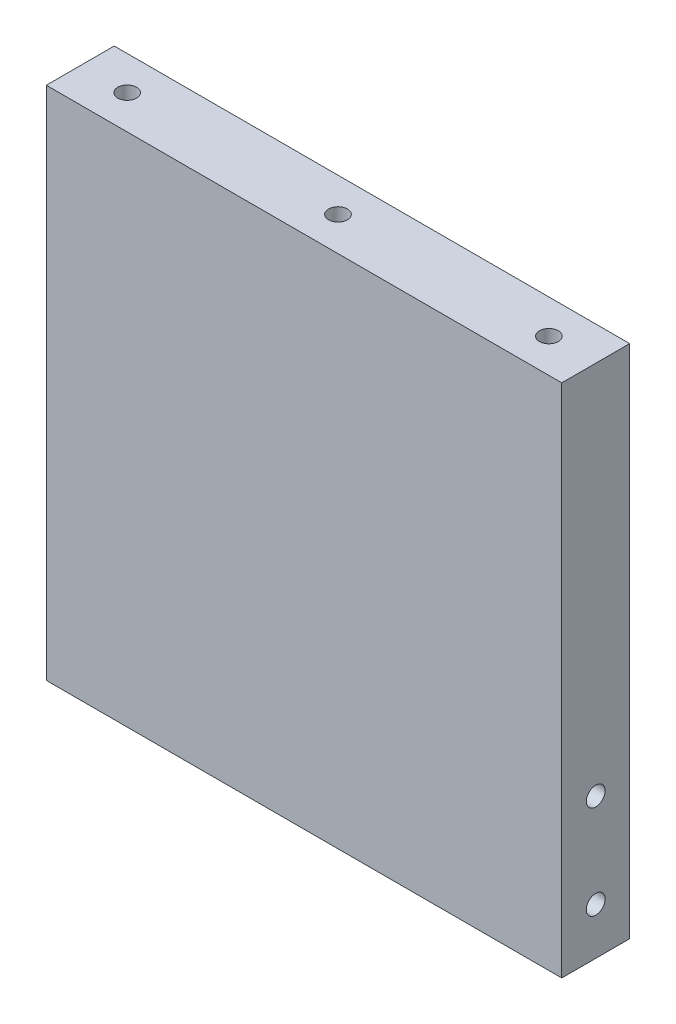
ISO-10303-21;
HEADER;
FILE_DESCRIPTION(('STEP AP214'),'2;1');
FILE_NAME('part.step','',(''),(''),'','','');
FILE_SCHEMA(('AUTOMOTIVE_DESIGN { 1 0 10303 214 1 1 1 1 }'));
ENDSEC;
DATA;
#1=APPLICATION_CONTEXT('core data for automotive mechanical design processes');
#2=APPLICATION_PROTOCOL_DEFINITION('international standard','automotive_design',2000,#1);
#3=PRODUCT_CONTEXT('',#1,'mechanical');
#4=PRODUCT('Part','Part','',(#3));
#5=PRODUCT_RELATED_PRODUCT_CATEGORY('part','',(#4));
#6=PRODUCT_DEFINITION_FORMATION('','',#4);
#7=PRODUCT_DEFINITION_CONTEXT('part definition',#1,'design');
#8=PRODUCT_DEFINITION('design','',#6,#7);
#9=PRODUCT_DEFINITION_SHAPE('','',#8);
#10=(LENGTH_UNIT() NAMED_UNIT(*) SI_UNIT(.MILLI.,.METRE.));
#11=(NAMED_UNIT(*) PLANE_ANGLE_UNIT() SI_UNIT($,.RADIAN.));
#12=(NAMED_UNIT(*) SI_UNIT($,.STERADIAN.) SOLID_ANGLE_UNIT());
#13=UNCERTAINTY_MEASURE_WITH_UNIT(LENGTH_MEASURE(1.E-05),#10,'distance_accuracy_value','');
#14=(GEOMETRIC_REPRESENTATION_CONTEXT(3) GLOBAL_UNCERTAINTY_ASSIGNED_CONTEXT((#13)) GLOBAL_UNIT_ASSIGNED_CONTEXT((#10,
#11,#12)) REPRESENTATION_CONTEXT('',''));
#15=CARTESIAN_POINT('',(0.,0.,0.));
#16=DIRECTION('',(0.,0.,1.));
#17=DIRECTION('',(1.,0.,0.));
#18=AXIS2_PLACEMENT_3D('',#15,#16,#17);
#19=CARTESIAN_POINT('',(0.,139.7,0.));
#20=DIRECTION('',(1.,0.,0.));
#21=DIRECTION('',(0.,0.,-1.));
#22=AXIS2_PLACEMENT_3D('',#19,#20,#21);
#23=PLANE('',#22);
#24=CARTESIAN_POINT('',(0.,38.1,-9.2075));
#25=DIRECTION('',(-1.,0.,0.));
#26=DIRECTION('',(0.,0.,1.));
#27=AXIS2_PLACEMENT_3D('',#24,#25,#26);
#28=CIRCLE('',#27,2.5527);
#29=CARTESIAN_POINT('',(0.,38.1,-6.6548));
#30=VERTEX_POINT('',#29);
#31=EDGE_CURVE('E144',#30,#30,#28,.T.);
#32=ORIENTED_EDGE('',*,*,#31,.F.);
#33=EDGE_LOOP('',(#32));
#34=FACE_BOUND('',#33,.T.);
#35=CARTESIAN_POINT('',(0.,12.7,-9.2075));
#36=DIRECTION('',(-1.,0.,0.));
#37=DIRECTION('',(0.,0.,1.));
#38=AXIS2_PLACEMENT_3D('',#35,#36,#37);
#39=CIRCLE('',#38,2.5527);
#40=CARTESIAN_POINT('',(0.,12.7,-6.6548));
#41=VERTEX_POINT('',#40);
#42=EDGE_CURVE('E143',#41,#41,#39,.T.);
#43=ORIENTED_EDGE('',*,*,#42,.F.);
#44=EDGE_LOOP('',(#43));
#45=FACE_BOUND('',#44,.T.);
#46=DIRECTION('',(0.,0.,1.));
#47=VECTOR('',#46,1.);
#48=CARTESIAN_POINT('',(0.,0.,0.));
#49=LINE('',#48,#47);
#50=CARTESIAN_POINT('',(0.,0.,-18.415));
#51=VERTEX_POINT('',#50);
#52=CARTESIAN_POINT('',(0.,0.,0.));
#53=VERTEX_POINT('',#52);
#54=EDGE_CURVE('E199',#51,#53,#49,.T.);
#55=ORIENTED_EDGE('',*,*,#54,.T.);
#56=DIRECTION('',(0.,-1.,0.));
#57=VECTOR('',#56,1.);
#58=CARTESIAN_POINT('',(0.,139.7,0.));
#59=LINE('',#58,#57);
#60=CARTESIAN_POINT('',(0.,139.7,0.));
#61=VERTEX_POINT('',#60);
#62=EDGE_CURVE('E13',#61,#53,#59,.T.);
#63=ORIENTED_EDGE('',*,*,#62,.F.);
#64=DIRECTION('',(0.,0.,1.));
#65=VECTOR('',#64,1.);
#66=CARTESIAN_POINT('',(0.,139.7,0.));
#67=LINE('',#66,#65);
#68=CARTESIAN_POINT('',(0.,139.7,-18.415));
#69=VERTEX_POINT('',#68);
#70=EDGE_CURVE('E200',#69,#61,#67,.T.);
#71=ORIENTED_EDGE('',*,*,#70,.F.);
#72=DIRECTION('',(0.,-1.,0.));
#73=VECTOR('',#72,1.);
#74=CARTESIAN_POINT('',(0.,139.7,-18.415));
#75=LINE('',#74,#73);
#76=EDGE_CURVE('E210',#69,#51,#75,.T.);
#77=ORIENTED_EDGE('',*,*,#76,.T.);
#78=EDGE_LOOP('',(#55,#63,#71,#77));
#79=FACE_BOUND('',#78,.T.);
#80=ADVANCED_FACE('F62',(#34,#45,#79),#23,.F.);
#81=CARTESIAN_POINT('',(0.,139.7,0.));
#82=DIRECTION('',(0.,0.,-1.));
#83=DIRECTION('',(-1.,0.,0.));
#84=AXIS2_PLACEMENT_3D('',#81,#82,#83);
#85=PLANE('',#84);
#86=DIRECTION('',(1.,0.,0.));
#87=VECTOR('',#86,1.);
#88=CARTESIAN_POINT('',(0.,0.,0.));
#89=LINE('',#88,#87);
#90=CARTESIAN_POINT('',(139.7,0.,0.));
#91=VERTEX_POINT('',#90);
#92=EDGE_CURVE('E214',#53,#91,#89,.T.);
#93=ORIENTED_EDGE('',*,*,#92,.T.);
#94=DIRECTION('',(0.,-1.,0.));
#95=VECTOR('',#94,1.);
#96=CARTESIAN_POINT('',(139.7,139.7,0.));
#97=LINE('',#96,#95);
#98=CARTESIAN_POINT('',(139.7,139.7,0.));
#99=VERTEX_POINT('',#98);
#100=EDGE_CURVE('E71',#99,#91,#97,.T.);
#101=ORIENTED_EDGE('',*,*,#100,.F.);
#102=DIRECTION('',(1.,0.,0.));
#103=VECTOR('',#102,1.);
#104=CARTESIAN_POINT('',(0.,139.7,0.));
#105=LINE('',#104,#103);
#106=EDGE_CURVE('E110',#61,#99,#105,.T.);
#107=ORIENTED_EDGE('',*,*,#106,.F.);
#108=ORIENTED_EDGE('',*,*,#62,.T.);
#109=EDGE_LOOP('',(#93,#101,#107,#108));
#110=FACE_BOUND('',#109,.T.);
#111=ADVANCED_FACE('F246',(#110),#85,.F.);
#112=CARTESIAN_POINT('',(139.7,139.7,0.));
#113=DIRECTION('',(-1.,0.,0.));
#114=DIRECTION('',(0.,0.,1.));
#115=AXIS2_PLACEMENT_3D('',#112,#113,#114);
#116=PLANE('',#115);
#117=CARTESIAN_POINT('',(139.7,38.1,-9.2075));
#118=DIRECTION('',(1.,0.,0.));
#119=DIRECTION('',(0.,0.,-1.));
#120=AXIS2_PLACEMENT_3D('',#117,#118,#119);
#121=CIRCLE('',#120,2.5527);
#122=CARTESIAN_POINT('',(139.7,38.1,-11.7602));
#123=VERTEX_POINT('',#122);
#124=EDGE_CURVE('E167',#123,#123,#121,.T.);
#125=ORIENTED_EDGE('',*,*,#124,.F.);
#126=EDGE_LOOP('',(#125));
#127=FACE_BOUND('',#126,.T.);
#128=CARTESIAN_POINT('',(139.7,12.7,-9.2075));
#129=DIRECTION('',(1.,0.,0.));
#130=DIRECTION('',(0.,0.,-1.));
#131=AXIS2_PLACEMENT_3D('',#128,#129,#130);
#132=CIRCLE('',#131,2.5527);
#133=CARTESIAN_POINT('',(139.7,12.7,-11.7602));
#134=VERTEX_POINT('',#133);
#135=EDGE_CURVE('E175',#134,#134,#132,.T.);
#136=ORIENTED_EDGE('',*,*,#135,.F.);
#137=EDGE_LOOP('',(#136));
#138=FACE_BOUND('',#137,.T.);
#139=DIRECTION('',(0.,0.,-1.));
#140=VECTOR('',#139,1.);
#141=CARTESIAN_POINT('',(139.7,0.,0.));
#142=LINE('',#141,#140);
#143=CARTESIAN_POINT('',(139.7,0.,-18.415));
#144=VERTEX_POINT('',#143);
#145=EDGE_CURVE('E97',#91,#144,#142,.T.);
#146=ORIENTED_EDGE('',*,*,#145,.T.);
#147=DIRECTION('',(0.,-1.,0.));
#148=VECTOR('',#147,1.);
#149=CARTESIAN_POINT('',(139.7,139.7,-18.415));
#150=LINE('',#149,#148);
#151=CARTESIAN_POINT('',(139.7,139.7,-18.415));
#152=VERTEX_POINT('',#151);
#153=EDGE_CURVE('E223',#152,#144,#150,.T.);
#154=ORIENTED_EDGE('',*,*,#153,.F.);
#155=DIRECTION('',(0.,0.,-1.));
#156=VECTOR('',#155,1.);
#157=CARTESIAN_POINT('',(139.7,139.7,0.));
#158=LINE('',#157,#156);
#159=EDGE_CURVE('E205',#99,#152,#158,.T.);
#160=ORIENTED_EDGE('',*,*,#159,.F.);
#161=ORIENTED_EDGE('',*,*,#100,.T.);
#162=EDGE_LOOP('',(#146,#154,#160,#161));
#163=FACE_BOUND('',#162,.T.);
#164=ADVANCED_FACE('F229',(#127,#138,#163),#116,.F.);
#165=CARTESIAN_POINT('',(0.,139.7,-18.415));
#166=DIRECTION('',(0.,0.,1.));
#167=DIRECTION('',(1.,0.,0.));
#168=AXIS2_PLACEMENT_3D('',#165,#166,#167);
#169=PLANE('',#168);
#170=DIRECTION('',(-1.,0.,0.));
#171=VECTOR('',#170,1.);
#172=CARTESIAN_POINT('',(0.,0.,-18.415));
#173=LINE('',#172,#171);
#174=EDGE_CURVE('E103',#144,#51,#173,.T.);
#175=ORIENTED_EDGE('',*,*,#174,.T.);
#176=ORIENTED_EDGE('',*,*,#76,.F.);
#177=DIRECTION('',(-1.,0.,0.));
#178=VECTOR('',#177,1.);
#179=CARTESIAN_POINT('',(0.,139.7,-18.415));
#180=LINE('',#179,#178);
#181=EDGE_CURVE('E79',#152,#69,#180,.T.);
#182=ORIENTED_EDGE('',*,*,#181,.F.);
#183=ORIENTED_EDGE('',*,*,#153,.T.);
#184=EDGE_LOOP('',(#175,#176,#182,#183));
#185=FACE_BOUND('',#184,.T.);
#186=ADVANCED_FACE('F236',(#185),#169,.F.);
#187=CARTESIAN_POINT('',(0.,139.7,0.));
#188=DIRECTION('',(0.,-1.,0.));
#189=DIRECTION('',(0.,0.,-1.));
#190=AXIS2_PLACEMENT_3D('',#187,#188,#189);
#191=PLANE('',#190);
#192=CARTESIAN_POINT('',(127.,139.7,-9.2075));
#193=DIRECTION('',(0.,1.,0.));
#194=DIRECTION('',(0.,0.,1.));
#195=AXIS2_PLACEMENT_3D('',#192,#193,#194);
#196=CIRCLE('',#195,2.55269999999999);
#197=CARTESIAN_POINT('',(127.,139.7,-6.65480000000001));
#198=VERTEX_POINT('',#197);
#199=EDGE_CURVE('E159',#198,#198,#196,.T.);
#200=ORIENTED_EDGE('',*,*,#199,.F.);
#201=EDGE_LOOP('',(#200));
#202=FACE_BOUND('',#201,.T.);
#203=CARTESIAN_POINT('',(69.85,139.7,-9.2075));
#204=DIRECTION('',(0.,1.,0.));
#205=DIRECTION('',(0.,0.,1.));
#206=AXIS2_PLACEMENT_3D('',#203,#204,#205);
#207=CIRCLE('',#206,2.55269999999999);
#208=CARTESIAN_POINT('',(69.85,139.7,-6.65480000000001));
#209=VERTEX_POINT('',#208);
#210=EDGE_CURVE('E183',#209,#209,#207,.T.);
#211=ORIENTED_EDGE('',*,*,#210,.F.);
#212=EDGE_LOOP('',(#211));
#213=FACE_BOUND('',#212,.T.);
#214=CARTESIAN_POINT('',(12.7,139.7,-9.2075));
#215=DIRECTION('',(0.,1.,0.));
#216=DIRECTION('',(0.,0.,1.));
#217=AXIS2_PLACEMENT_3D('',#214,#215,#216);
#218=CIRCLE('',#217,2.5527);
#219=CARTESIAN_POINT('',(12.7,139.7,-6.6548));
#220=VERTEX_POINT('',#219);
#221=EDGE_CURVE('E191',#220,#220,#218,.T.);
#222=ORIENTED_EDGE('',*,*,#221,.F.);
#223=EDGE_LOOP('',(#222));
#224=FACE_BOUND('',#223,.T.);
#225=ORIENTED_EDGE('',*,*,#70,.T.);
#226=ORIENTED_EDGE('',*,*,#106,.T.);
#227=ORIENTED_EDGE('',*,*,#159,.T.);
#228=ORIENTED_EDGE('',*,*,#181,.T.);
#229=EDGE_LOOP('',(#225,#226,#227,#228));
#230=FACE_BOUND('',#229,.T.);
#231=ADVANCED_FACE('F238',(#202,#213,#224,#230),#191,.F.);
#232=CARTESIAN_POINT('',(0.,0.,0.));
#233=DIRECTION('',(0.,-1.,0.));
#234=DIRECTION('',(0.,0.,-1.));
#235=AXIS2_PLACEMENT_3D('',#232,#233,#234);
#236=PLANE('',#235);
#237=ORIENTED_EDGE('',*,*,#54,.F.);
#238=ORIENTED_EDGE('',*,*,#174,.F.);
#239=ORIENTED_EDGE('',*,*,#145,.F.);
#240=ORIENTED_EDGE('',*,*,#92,.F.);
#241=EDGE_LOOP('',(#237,#238,#239,#240));
#242=FACE_BOUND('',#241,.T.);
#243=ADVANCED_FACE('F232',(#242),#236,.T.);
#244=CARTESIAN_POINT('',(12.7,120.65,-9.2075));
#245=DIRECTION('',(0.,1.,0.));
#246=DIRECTION('',(0.,0.,1.));
#247=AXIS2_PLACEMENT_3D('',#244,#245,#246);
#248=CONICAL_SURFACE('',#247,2.5527,1.02974425867665);
#249=CARTESIAN_POINT('',(12.7,119.116183097808,-9.2075));
#250=VERTEX_POINT('',#249);
#251=VERTEX_LOOP('',#250);
#252=FACE_BOUND('',#251,.T.);
#253=CARTESIAN_POINT('',(12.7,120.65,-9.2075));
#254=DIRECTION('',(0.,1.,0.));
#255=DIRECTION('',(0.,0.,1.));
#256=AXIS2_PLACEMENT_3D('',#253,#254,#255);
#257=CIRCLE('',#256,2.5527);
#258=CARTESIAN_POINT('',(12.7,120.65,-6.6548));
#259=VERTEX_POINT('',#258);
#260=EDGE_CURVE('E195',#259,#259,#257,.T.);
#261=ORIENTED_EDGE('',*,*,#260,.T.);
#262=EDGE_LOOP('',(#261));
#263=FACE_BOUND('',#262,.T.);
#264=ADVANCED_FACE('F306',(#252,#263),#248,.F.);
#265=CARTESIAN_POINT('',(12.7,139.7,-9.2075));
#266=DIRECTION('',(0.,1.,0.));
#267=DIRECTION('',(0.,0.,1.));
#268=AXIS2_PLACEMENT_3D('',#265,#266,#267);
#269=CYLINDRICAL_SURFACE('',#268,2.5527);
#270=ORIENTED_EDGE('',*,*,#260,.F.);
#271=EDGE_LOOP('',(#270));
#272=FACE_BOUND('',#271,.T.);
#273=ORIENTED_EDGE('',*,*,#221,.T.);
#274=EDGE_LOOP('',(#273));
#275=FACE_BOUND('',#274,.T.);
#276=ADVANCED_FACE('F302',(#272,#275),#269,.F.);
#277=CARTESIAN_POINT('',(69.85,120.65,-9.2075));
#278=DIRECTION('',(0.,1.,0.));
#279=DIRECTION('',(0.,0.,1.));
#280=AXIS2_PLACEMENT_3D('',#277,#278,#279);
#281=CONICAL_SURFACE('',#280,2.55269999999999,1.02974425867665);
#282=CARTESIAN_POINT('',(69.85,119.116183097808,-9.2075));
#283=VERTEX_POINT('',#282);
#284=VERTEX_LOOP('',#283);
#285=FACE_BOUND('',#284,.T.);
#286=CARTESIAN_POINT('',(69.85,120.65,-9.2075));
#287=DIRECTION('',(0.,1.,0.));
#288=DIRECTION('',(0.,0.,1.));
#289=AXIS2_PLACEMENT_3D('',#286,#287,#288);
#290=CIRCLE('',#289,2.55269999999999);
#291=CARTESIAN_POINT('',(69.85,120.65,-6.65480000000001));
#292=VERTEX_POINT('',#291);
#293=EDGE_CURVE('E187',#292,#292,#290,.T.);
#294=ORIENTED_EDGE('',*,*,#293,.T.);
#295=EDGE_LOOP('',(#294));
#296=FACE_BOUND('',#295,.T.);
#297=ADVANCED_FACE('F298',(#285,#296),#281,.F.);
#298=CARTESIAN_POINT('',(69.85,139.7,-9.2075));
#299=DIRECTION('',(0.,1.,0.));
#300=DIRECTION('',(0.,0.,1.));
#301=AXIS2_PLACEMENT_3D('',#298,#299,#300);
#302=CYLINDRICAL_SURFACE('',#301,2.55269999999999);
#303=ORIENTED_EDGE('',*,*,#293,.F.);
#304=EDGE_LOOP('',(#303));
#305=FACE_BOUND('',#304,.T.);
#306=ORIENTED_EDGE('',*,*,#210,.T.);
#307=EDGE_LOOP('',(#306));
#308=FACE_BOUND('',#307,.T.);
#309=ADVANCED_FACE('F294',(#305,#308),#302,.F.);
#310=CARTESIAN_POINT('',(120.65,12.7,-9.2075));
#311=DIRECTION('',(1.,0.,0.));
#312=DIRECTION('',(0.,0.,-1.));
#313=AXIS2_PLACEMENT_3D('',#310,#311,#312);
#314=CONICAL_SURFACE('',#313,2.5527,1.02974425867665);
#315=CARTESIAN_POINT('',(119.116183097808,12.7,-9.2075));
#316=VERTEX_POINT('',#315);
#317=VERTEX_LOOP('',#316);
#318=FACE_BOUND('',#317,.T.);
#319=CARTESIAN_POINT('',(120.65,12.7,-9.2075));
#320=DIRECTION('',(1.,0.,0.));
#321=DIRECTION('',(0.,0.,-1.));
#322=AXIS2_PLACEMENT_3D('',#319,#320,#321);
#323=CIRCLE('',#322,2.5527);
#324=CARTESIAN_POINT('',(120.65,12.7,-11.7602));
#325=VERTEX_POINT('',#324);
#326=EDGE_CURVE('E179',#325,#325,#323,.T.);
#327=ORIENTED_EDGE('',*,*,#326,.T.);
#328=EDGE_LOOP('',(#327));
#329=FACE_BOUND('',#328,.T.);
#330=ADVANCED_FACE('F290',(#318,#329),#314,.F.);
#331=CARTESIAN_POINT('',(139.7,12.7,-9.2075));
#332=DIRECTION('',(1.,0.,0.));
#333=DIRECTION('',(0.,0.,-1.));
#334=AXIS2_PLACEMENT_3D('',#331,#332,#333);
#335=CYLINDRICAL_SURFACE('',#334,2.5527);
#336=ORIENTED_EDGE('',*,*,#326,.F.);
#337=EDGE_LOOP('',(#336));
#338=FACE_BOUND('',#337,.T.);
#339=ORIENTED_EDGE('',*,*,#135,.T.);
#340=EDGE_LOOP('',(#339));
#341=FACE_BOUND('',#340,.T.);
#342=ADVANCED_FACE('F286',(#338,#341),#335,.F.);
#343=CARTESIAN_POINT('',(120.65,38.1,-9.2075));
#344=DIRECTION('',(1.,0.,0.));
#345=DIRECTION('',(0.,0.,-1.));
#346=AXIS2_PLACEMENT_3D('',#343,#344,#345);
#347=CONICAL_SURFACE('',#346,2.5527,1.02974425867665);
#348=CARTESIAN_POINT('',(119.116183097808,38.1,-9.2075));
#349=VERTEX_POINT('',#348);
#350=VERTEX_LOOP('',#349);
#351=FACE_BOUND('',#350,.T.);
#352=CARTESIAN_POINT('',(120.65,38.1,-9.2075));
#353=DIRECTION('',(1.,0.,0.));
#354=DIRECTION('',(0.,0.,-1.));
#355=AXIS2_PLACEMENT_3D('',#352,#353,#354);
#356=CIRCLE('',#355,2.5527);
#357=CARTESIAN_POINT('',(120.65,38.1,-11.7602));
#358=VERTEX_POINT('',#357);
#359=EDGE_CURVE('E171',#358,#358,#356,.T.);
#360=ORIENTED_EDGE('',*,*,#359,.T.);
#361=EDGE_LOOP('',(#360));
#362=FACE_BOUND('',#361,.T.);
#363=ADVANCED_FACE('F282',(#351,#362),#347,.F.);
#364=CARTESIAN_POINT('',(139.7,38.1,-9.2075));
#365=DIRECTION('',(1.,0.,0.));
#366=DIRECTION('',(0.,0.,-1.));
#367=AXIS2_PLACEMENT_3D('',#364,#365,#366);
#368=CYLINDRICAL_SURFACE('',#367,2.5527);
#369=ORIENTED_EDGE('',*,*,#359,.F.);
#370=EDGE_LOOP('',(#369));
#371=FACE_BOUND('',#370,.T.);
#372=ORIENTED_EDGE('',*,*,#124,.T.);
#373=EDGE_LOOP('',(#372));
#374=FACE_BOUND('',#373,.T.);
#375=ADVANCED_FACE('F278',(#371,#374),#368,.F.);
#376=CARTESIAN_POINT('',(127.,120.65,-9.2075));
#377=DIRECTION('',(0.,1.,0.));
#378=DIRECTION('',(0.,0.,1.));
#379=AXIS2_PLACEMENT_3D('',#376,#377,#378);
#380=CONICAL_SURFACE('',#379,2.55269999999999,1.02974425867665);
#381=CARTESIAN_POINT('',(127.,119.116183097808,-9.2075));
#382=VERTEX_POINT('',#381);
#383=VERTEX_LOOP('',#382);
#384=FACE_BOUND('',#383,.T.);
#385=CARTESIAN_POINT('',(127.,120.65,-9.2075));
#386=DIRECTION('',(0.,1.,0.));
#387=DIRECTION('',(0.,0.,1.));
#388=AXIS2_PLACEMENT_3D('',#385,#386,#387);
#389=CIRCLE('',#388,2.55269999999999);
#390=CARTESIAN_POINT('',(127.,120.65,-6.65480000000001));
#391=VERTEX_POINT('',#390);
#392=EDGE_CURVE('E163',#391,#391,#389,.T.);
#393=ORIENTED_EDGE('',*,*,#392,.T.);
#394=EDGE_LOOP('',(#393));
#395=FACE_BOUND('',#394,.T.);
#396=ADVANCED_FACE('F274',(#384,#395),#380,.F.);
#397=CARTESIAN_POINT('',(127.,139.7,-9.2075));
#398=DIRECTION('',(0.,1.,0.));
#399=DIRECTION('',(0.,0.,1.));
#400=AXIS2_PLACEMENT_3D('',#397,#398,#399);
#401=CYLINDRICAL_SURFACE('',#400,2.55269999999999);
#402=ORIENTED_EDGE('',*,*,#392,.F.);
#403=EDGE_LOOP('',(#402));
#404=FACE_BOUND('',#403,.T.);
#405=ORIENTED_EDGE('',*,*,#199,.T.);
#406=EDGE_LOOP('',(#405));
#407=FACE_BOUND('',#406,.T.);
#408=ADVANCED_FACE('F266',(#404,#407),#401,.F.);
#409=CARTESIAN_POINT('',(19.05,12.7,-9.2075));
#410=DIRECTION('',(-1.,0.,0.));
#411=DIRECTION('',(0.,0.,1.));
#412=AXIS2_PLACEMENT_3D('',#409,#410,#411);
#413=CONICAL_SURFACE('',#412,2.5527,1.02974425867665);
#414=CARTESIAN_POINT('',(20.5838169021917,12.7,-9.2075));
#415=VERTEX_POINT('',#414);
#416=VERTEX_LOOP('',#415);
#417=FACE_BOUND('',#416,.T.);
#418=CARTESIAN_POINT('',(19.05,12.7,-9.2075));
#419=DIRECTION('',(-1.,0.,0.));
#420=DIRECTION('',(0.,0.,1.));
#421=AXIS2_PLACEMENT_3D('',#418,#419,#420);
#422=CIRCLE('',#421,2.5527);
#423=CARTESIAN_POINT('',(19.05,12.7,-6.6548));
#424=VERTEX_POINT('',#423);
#425=EDGE_CURVE('E151',#424,#424,#422,.T.);
#426=ORIENTED_EDGE('',*,*,#425,.T.);
#427=EDGE_LOOP('',(#426));
#428=FACE_BOUND('',#427,.T.);
#429=ADVANCED_FACE('F260',(#417,#428),#413,.F.);
#430=CARTESIAN_POINT('',(0.,12.7,-9.2075));
#431=DIRECTION('',(-1.,0.,0.));
#432=DIRECTION('',(0.,0.,1.));
#433=AXIS2_PLACEMENT_3D('',#430,#431,#432);
#434=CYLINDRICAL_SURFACE('',#433,2.5527);
#435=ORIENTED_EDGE('',*,*,#425,.F.);
#436=EDGE_LOOP('',(#435));
#437=FACE_BOUND('',#436,.T.);
#438=ORIENTED_EDGE('',*,*,#42,.T.);
#439=EDGE_LOOP('',(#438));
#440=FACE_BOUND('',#439,.T.);
#441=ADVANCED_FACE('F136',(#437,#440),#434,.F.);
#442=CARTESIAN_POINT('',(19.05,38.1,-9.2075));
#443=DIRECTION('',(-1.,0.,0.));
#444=DIRECTION('',(0.,0.,1.));
#445=AXIS2_PLACEMENT_3D('',#442,#443,#444);
#446=CONICAL_SURFACE('',#445,2.5527,1.02974425867665);
#447=CARTESIAN_POINT('',(20.5838169021917,38.1,-9.2075));
#448=VERTEX_POINT('',#447);
#449=VERTEX_LOOP('',#448);
#450=FACE_BOUND('',#449,.T.);
#451=CARTESIAN_POINT('',(19.05,38.1,-9.2075));
#452=DIRECTION('',(-1.,0.,0.));
#453=DIRECTION('',(0.,0.,1.));
#454=AXIS2_PLACEMENT_3D('',#451,#452,#453);
#455=CIRCLE('',#454,2.5527);
#456=CARTESIAN_POINT('',(19.05,38.1,-6.6548));
#457=VERTEX_POINT('',#456);
#458=EDGE_CURVE('E140',#457,#457,#455,.T.);
#459=ORIENTED_EDGE('',*,*,#458,.T.);
#460=EDGE_LOOP('',(#459));
#461=FACE_BOUND('',#460,.T.);
#462=ADVANCED_FACE('F132',(#450,#461),#446,.F.);
#463=CARTESIAN_POINT('',(0.,38.1,-9.2075));
#464=DIRECTION('',(-1.,0.,0.));
#465=DIRECTION('',(0.,0.,1.));
#466=AXIS2_PLACEMENT_3D('',#463,#464,#465);
#467=CYLINDRICAL_SURFACE('',#466,2.5527);
#468=ORIENTED_EDGE('',*,*,#458,.F.);
#469=EDGE_LOOP('',(#468));
#470=FACE_BOUND('',#469,.T.);
#471=ORIENTED_EDGE('',*,*,#31,.T.);
#472=EDGE_LOOP('',(#471));
#473=FACE_BOUND('',#472,.T.);
#474=ADVANCED_FACE('F135',(#470,#473),#467,.F.);
#475=CLOSED_SHELL('',(#80,#111,#164,#186,#231,#243,#264,#276,#297,#309,#330,#342,#363,#375,#396,
#408,#429,#441,#462,#474));
#476=MANIFOLD_SOLID_BREP('B2',#475);
#477=ADVANCED_BREP_SHAPE_REPRESENTATION('',(#18,#476),#14);
#478=SHAPE_DEFINITION_REPRESENTATION(#9,#477);
ENDSEC;
END-ISO-10303-21;
